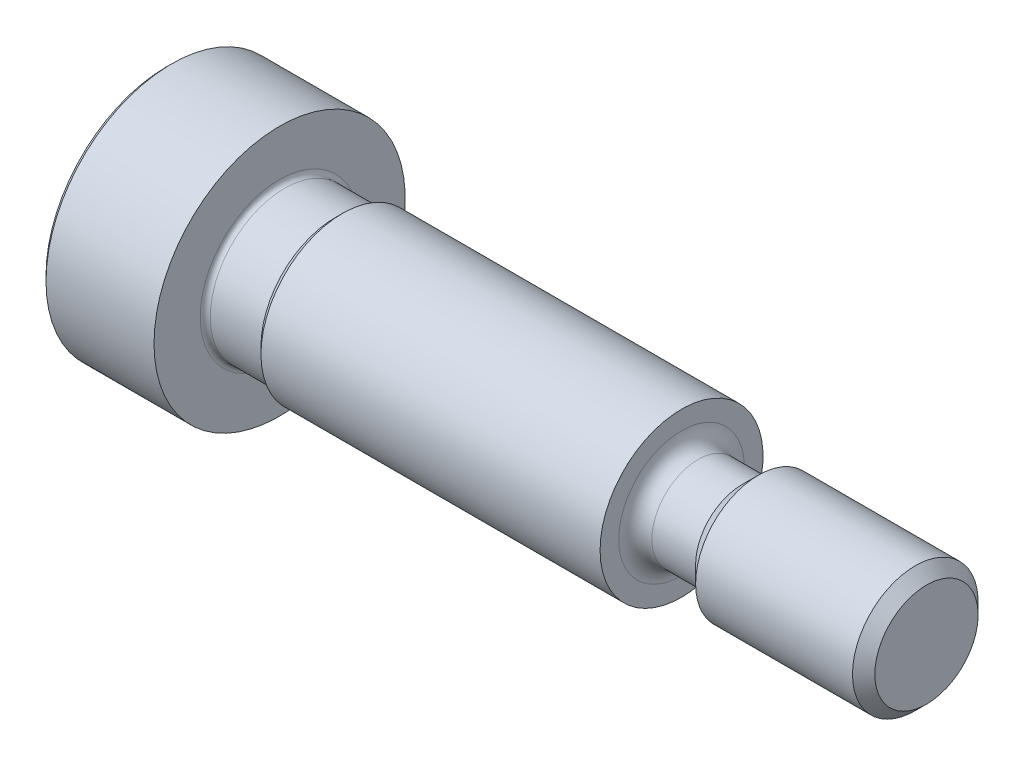
ISO-10303-21;
HEADER;
FILE_DESCRIPTION(('STEP AP214'),'2;1');
FILE_NAME('part.step','',(''),(''),'','','');
FILE_SCHEMA(('AUTOMOTIVE_DESIGN { 1 0 10303 214 1 1 1 1 }'));
ENDSEC;
DATA;
#1=APPLICATION_CONTEXT('core data for automotive mechanical design processes');
#2=APPLICATION_PROTOCOL_DEFINITION('international standard','automotive_design',2000,#1);
#3=PRODUCT_CONTEXT('',#1,'mechanical');
#4=PRODUCT('Part','Part','',(#3));
#5=PRODUCT_RELATED_PRODUCT_CATEGORY('part','',(#4));
#6=PRODUCT_DEFINITION_FORMATION('','',#4);
#7=PRODUCT_DEFINITION_CONTEXT('part definition',#1,'design');
#8=PRODUCT_DEFINITION('design','',#6,#7);
#9=PRODUCT_DEFINITION_SHAPE('','',#8);
#10=(LENGTH_UNIT() NAMED_UNIT(*) SI_UNIT(.MILLI.,.METRE.));
#11=(NAMED_UNIT(*) PLANE_ANGLE_UNIT() SI_UNIT($,.RADIAN.));
#12=(NAMED_UNIT(*) SI_UNIT($,.STERADIAN.) SOLID_ANGLE_UNIT());
#13=UNCERTAINTY_MEASURE_WITH_UNIT(LENGTH_MEASURE(1.E-05),#10,'distance_accuracy_value','');
#14=(GEOMETRIC_REPRESENTATION_CONTEXT(3) GLOBAL_UNCERTAINTY_ASSIGNED_CONTEXT((#13)) GLOBAL_UNIT_ASSIGNED_CONTEXT((#10,
#11,#12)) REPRESENTATION_CONTEXT('',''));
#15=CARTESIAN_POINT('',(0.,0.,0.));
#16=DIRECTION('',(0.,0.,1.));
#17=DIRECTION('',(1.,0.,0.));
#18=AXIS2_PLACEMENT_3D('',#15,#16,#17);
#19=CARTESIAN_POINT('',(0.,0.,0.));
#20=DIRECTION('',(-1.,0.,0.));
#21=DIRECTION('',(0.,0.,1.));
#22=AXIS2_PLACEMENT_3D('',#19,#20,#21);
#23=PLANE('',#22);
#24=CARTESIAN_POINT('',(0.,0.,0.));
#25=DIRECTION('',(-1.,0.,0.));
#26=DIRECTION('',(0.,0.,1.));
#27=AXIS2_PLACEMENT_3D('',#24,#25,#26);
#28=CIRCLE('',#27,4.8);
#29=CARTESIAN_POINT('',(0.,0.,4.8));
#30=VERTEX_POINT('',#29);
#31=EDGE_CURVE('E41',#30,#30,#28,.T.);
#32=ORIENTED_EDGE('',*,*,#31,.T.);
#33=EDGE_LOOP('',(#32));
#34=FACE_BOUND('',#33,.T.);
#35=DIRECTION('',(0.,-0.500000000000001,-0.866025403784438));
#36=VECTOR('',#35,1.);
#37=CARTESIAN_POINT('',(0.,-0.889119414552023,1.54));
#38=LINE('',#37,#36);
#39=CARTESIAN_POINT('',(0.,-0.889119414552023,1.54));
#40=VERTEX_POINT('',#39);
#41=CARTESIAN_POINT('',(0.,-1.77823882910405,0.));
#42=VERTEX_POINT('',#41);
#43=EDGE_CURVE('E48',#40,#42,#38,.T.);
#44=ORIENTED_EDGE('',*,*,#43,.T.);
#45=DIRECTION('',(0.,0.500000000000001,-0.866025403784438));
#46=VECTOR('',#45,1.);
#47=CARTESIAN_POINT('',(0.,-1.77823882910405,0.));
#48=LINE('',#47,#46);
#49=CARTESIAN_POINT('',(0.,-0.889119414552023,-1.54));
#50=VERTEX_POINT('',#49);
#51=EDGE_CURVE('E323',#42,#50,#48,.T.);
#52=ORIENTED_EDGE('',*,*,#51,.T.);
#53=DIRECTION('',(0.,1.,0.));
#54=VECTOR('',#53,1.);
#55=CARTESIAN_POINT('',(0.,-0.889119414552023,-1.54));
#56=LINE('',#55,#54);
#57=CARTESIAN_POINT('',(0.,0.889119414552023,-1.54));
#58=VERTEX_POINT('',#57);
#59=EDGE_CURVE('E128',#50,#58,#56,.T.);
#60=ORIENTED_EDGE('',*,*,#59,.T.);
#61=DIRECTION('',(0.,0.500000000000001,0.866025403784438));
#62=VECTOR('',#61,1.);
#63=CARTESIAN_POINT('',(0.,0.889119414552023,-1.54));
#64=LINE('',#63,#62);
#65=CARTESIAN_POINT('',(0.,1.77823882910405,0.));
#66=VERTEX_POINT('',#65);
#67=EDGE_CURVE('E326',#58,#66,#64,.T.);
#68=ORIENTED_EDGE('',*,*,#67,.T.);
#69=DIRECTION('',(0.,-0.500000000000001,0.866025403784438));
#70=VECTOR('',#69,1.);
#71=CARTESIAN_POINT('',(0.,1.77823882910405,0.));
#72=LINE('',#71,#70);
#73=CARTESIAN_POINT('',(0.,0.889119414552023,1.54));
#74=VERTEX_POINT('',#73);
#75=EDGE_CURVE('E328',#66,#74,#72,.T.);
#76=ORIENTED_EDGE('',*,*,#75,.T.);
#77=DIRECTION('',(0.,-1.,0.));
#78=VECTOR('',#77,1.);
#79=CARTESIAN_POINT('',(0.,0.889119414552023,1.54));
#80=LINE('',#79,#78);
#81=EDGE_CURVE('E330',#74,#40,#80,.T.);
#82=ORIENTED_EDGE('',*,*,#81,.T.);
#83=EDGE_LOOP('',(#44,#52,#60,#68,#76,#82));
#84=FACE_BOUND('',#83,.T.);
#85=ADVANCED_FACE('F33',(#34,#84),#23,.T.);
#86=CARTESIAN_POINT('',(-6.34999999999999,0.,0.));
#87=DIRECTION('',(-1.,0.,0.));
#88=DIRECTION('',(0.,0.,1.));
#89=AXIS2_PLACEMENT_3D('',#86,#87,#88);
#90=CYLINDRICAL_SURFACE('',#89,5.);
#91=CARTESIAN_POINT('',(0.200000000000001,0.,0.));
#92=DIRECTION('',(-1.,0.,0.));
#93=DIRECTION('',(0.,0.,1.));
#94=AXIS2_PLACEMENT_3D('',#91,#92,#93);
#95=CIRCLE('',#94,5.);
#96=CARTESIAN_POINT('',(0.200000000000001,0.,5.));
#97=VERTEX_POINT('',#96);
#98=EDGE_CURVE('E11',#97,#97,#95,.F.);
#99=ORIENTED_EDGE('',*,*,#98,.T.);
#100=EDGE_LOOP('',(#99));
#101=FACE_BOUND('',#100,.T.);
#102=CARTESIAN_POINT('',(4.5,0.,0.));
#103=DIRECTION('',(-1.,0.,0.));
#104=DIRECTION('',(0.,0.,1.));
#105=AXIS2_PLACEMENT_3D('',#102,#103,#104);
#106=CIRCLE('',#105,5.);
#107=CARTESIAN_POINT('',(4.5,0.,5.));
#108=VERTEX_POINT('',#107);
#109=EDGE_CURVE('E175',#108,#108,#106,.T.);
#110=ORIENTED_EDGE('',*,*,#109,.T.);
#111=EDGE_LOOP('',(#110));
#112=FACE_BOUND('',#111,.T.);
#113=ADVANCED_FACE('F194',(#101,#112),#90,.T.);
#114=CARTESIAN_POINT('',(4.5,5.,0.));
#115=DIRECTION('',(1.,0.,0.));
#116=DIRECTION('',(0.,0.,-1.));
#117=AXIS2_PLACEMENT_3D('',#114,#115,#116);
#118=PLANE('',#117);
#119=CARTESIAN_POINT('',(4.5,0.,0.));
#120=DIRECTION('',(-1.,0.,0.));
#121=DIRECTION('',(0.,0.,1.));
#122=AXIS2_PLACEMENT_3D('',#119,#120,#121);
#123=CIRCLE('',#122,3.16);
#124=CARTESIAN_POINT('',(4.5,0.,3.16));
#125=VERTEX_POINT('',#124);
#126=EDGE_CURVE('E172',#125,#125,#123,.T.);
#127=ORIENTED_EDGE('',*,*,#126,.T.);
#128=EDGE_LOOP('',(#127));
#129=FACE_BOUND('',#128,.T.);
#130=ORIENTED_EDGE('',*,*,#109,.F.);
#131=EDGE_LOOP('',(#130));
#132=FACE_BOUND('',#131,.T.);
#133=ADVANCED_FACE('F198',(#129,#132),#118,.T.);
#134=CARTESIAN_POINT('',(4.7,0.,0.));
#135=DIRECTION('',(-1.,0.,0.));
#136=DIRECTION('',(0.,0.,1.));
#137=AXIS2_PLACEMENT_3D('',#134,#135,#136);
#138=TOROIDAL_SURFACE('',#137,3.16,0.200000000000001);
#139=ORIENTED_EDGE('',*,*,#126,.F.);
#140=EDGE_LOOP('',(#139));
#141=FACE_BOUND('',#140,.T.);
#142=CARTESIAN_POINT('',(4.7,0.,0.));
#143=DIRECTION('',(-1.,0.,0.));
#144=DIRECTION('',(0.,0.,1.));
#145=AXIS2_PLACEMENT_3D('',#142,#143,#144);
#146=CIRCLE('',#145,2.96);
#147=CARTESIAN_POINT('',(4.7,0.,2.96));
#148=VERTEX_POINT('',#147);
#149=EDGE_CURVE('E169',#148,#148,#146,.T.);
#150=ORIENTED_EDGE('',*,*,#149,.T.);
#151=EDGE_LOOP('',(#150));
#152=FACE_BOUND('',#151,.T.);
#153=ADVANCED_FACE('F204',(#141,#152),#138,.F.);
#154=CARTESIAN_POINT('',(-6.34999999999999,0.,0.));
#155=DIRECTION('',(-1.,0.,0.));
#156=DIRECTION('',(0.,0.,1.));
#157=AXIS2_PLACEMENT_3D('',#154,#155,#156);
#158=CYLINDRICAL_SURFACE('',#157,2.96);
#159=CARTESIAN_POINT('',(6.7165,0.,0.));
#160=DIRECTION('',(-1.,0.,0.));
#161=DIRECTION('',(0.,0.,1.));
#162=AXIS2_PLACEMENT_3D('',#159,#160,#161);
#163=CIRCLE('',#162,2.96);
#164=CARTESIAN_POINT('',(6.7165,0.,2.96));
#165=VERTEX_POINT('',#164);
#166=EDGE_CURVE('E166',#165,#165,#163,.T.);
#167=ORIENTED_EDGE('',*,*,#166,.T.);
#168=EDGE_LOOP('',(#167));
#169=FACE_BOUND('',#168,.T.);
#170=ORIENTED_EDGE('',*,*,#149,.F.);
#171=EDGE_LOOP('',(#170));
#172=FACE_BOUND('',#171,.T.);
#173=ADVANCED_FACE('F208',(#169,#172),#158,.T.);
#174=CARTESIAN_POINT('',(6.7165,0.,0.));
#175=DIRECTION('',(1.,0.,0.));
#176=DIRECTION('',(0.,0.,-1.));
#177=AXIS2_PLACEMENT_3D('',#174,#175,#176);
#178=CONICAL_SURFACE('',#177,2.96,0.78539816339745);
#179=CARTESIAN_POINT('',(7.,0.,0.));
#180=DIRECTION('',(-1.,0.,0.));
#181=DIRECTION('',(0.,0.,1.));
#182=AXIS2_PLACEMENT_3D('',#179,#180,#181);
#183=CIRCLE('',#182,3.2435);
#184=CARTESIAN_POINT('',(7.,0.,3.2435));
#185=VERTEX_POINT('',#184);
#186=EDGE_CURVE('E163',#185,#185,#183,.T.);
#187=ORIENTED_EDGE('',*,*,#186,.T.);
#188=EDGE_LOOP('',(#187));
#189=FACE_BOUND('',#188,.T.);
#190=ORIENTED_EDGE('',*,*,#166,.F.);
#191=EDGE_LOOP('',(#190));
#192=FACE_BOUND('',#191,.T.);
#193=ADVANCED_FACE('F212',(#189,#192),#178,.T.);
#194=CARTESIAN_POINT('',(-6.34999999999999,0.,0.));
#195=DIRECTION('',(-1.,0.,0.));
#196=DIRECTION('',(0.,0.,1.));
#197=AXIS2_PLACEMENT_3D('',#194,#195,#196);
#198=CYLINDRICAL_SURFACE('',#197,3.2435);
#199=CARTESIAN_POINT('',(20.5,0.,0.));
#200=DIRECTION('',(-1.,0.,0.));
#201=DIRECTION('',(0.,0.,1.));
#202=AXIS2_PLACEMENT_3D('',#199,#200,#201);
#203=CIRCLE('',#202,3.2435);
#204=CARTESIAN_POINT('',(20.5,0.,3.2435));
#205=VERTEX_POINT('',#204);
#206=EDGE_CURVE('E160',#205,#205,#203,.T.);
#207=ORIENTED_EDGE('',*,*,#206,.T.);
#208=EDGE_LOOP('',(#207));
#209=FACE_BOUND('',#208,.T.);
#210=ORIENTED_EDGE('',*,*,#186,.F.);
#211=EDGE_LOOP('',(#210));
#212=FACE_BOUND('',#211,.T.);
#213=ADVANCED_FACE('F216',(#209,#212),#198,.T.);
#214=CARTESIAN_POINT('',(20.5,3.2435,0.));
#215=DIRECTION('',(1.,0.,0.));
#216=DIRECTION('',(0.,0.,-1.));
#217=AXIS2_PLACEMENT_3D('',#214,#215,#216);
#218=PLANE('',#217);
#219=CARTESIAN_POINT('',(20.5,0.,0.));
#220=DIRECTION('',(-1.,0.,0.));
#221=DIRECTION('',(0.,0.,1.));
#222=AXIS2_PLACEMENT_3D('',#219,#220,#221);
#223=CIRCLE('',#222,2.5);
#224=CARTESIAN_POINT('',(20.5,0.,2.5));
#225=VERTEX_POINT('',#224);
#226=EDGE_CURVE('E157',#225,#225,#223,.T.);
#227=ORIENTED_EDGE('',*,*,#226,.T.);
#228=EDGE_LOOP('',(#227));
#229=FACE_BOUND('',#228,.T.);
#230=ORIENTED_EDGE('',*,*,#206,.F.);
#231=EDGE_LOOP('',(#230));
#232=FACE_BOUND('',#231,.T.);
#233=ADVANCED_FACE('F220',(#229,#232),#218,.T.);
#234=CARTESIAN_POINT('',(21.16,0.,0.));
#235=DIRECTION('',(-1.,0.,0.));
#236=DIRECTION('',(0.,0.,1.));
#237=AXIS2_PLACEMENT_3D('',#234,#235,#236);
#238=TOROIDAL_SURFACE('',#237,2.5,0.66);
#239=CARTESIAN_POINT('',(21.16,0.,0.));
#240=DIRECTION('',(-1.,0.,0.));
#241=DIRECTION('',(0.,0.,1.));
#242=AXIS2_PLACEMENT_3D('',#239,#240,#241);
#243=CIRCLE('',#242,1.84);
#244=CARTESIAN_POINT('',(21.16,0.,1.84));
#245=VERTEX_POINT('',#244);
#246=EDGE_CURVE('E154',#245,#245,#243,.T.);
#247=ORIENTED_EDGE('',*,*,#246,.T.);
#248=EDGE_LOOP('',(#247));
#249=FACE_BOUND('',#248,.T.);
#250=ORIENTED_EDGE('',*,*,#226,.F.);
#251=EDGE_LOOP('',(#250));
#252=FACE_BOUND('',#251,.T.);
#253=ADVANCED_FACE('F224',(#249,#252),#238,.F.);
#254=CARTESIAN_POINT('',(-6.34999999999999,0.,0.));
#255=DIRECTION('',(-1.,0.,0.));
#256=DIRECTION('',(0.,0.,1.));
#257=AXIS2_PLACEMENT_3D('',#254,#255,#256);
#258=CYLINDRICAL_SURFACE('',#257,1.84);
#259=CARTESIAN_POINT('',(22.9,0.,0.));
#260=DIRECTION('',(-1.,0.,0.));
#261=DIRECTION('',(0.,0.,1.));
#262=AXIS2_PLACEMENT_3D('',#259,#260,#261);
#263=CIRCLE('',#262,1.84);
#264=CARTESIAN_POINT('',(22.9,0.,1.84));
#265=VERTEX_POINT('',#264);
#266=EDGE_CURVE('E151',#265,#265,#263,.T.);
#267=ORIENTED_EDGE('',*,*,#266,.T.);
#268=EDGE_LOOP('',(#267));
#269=FACE_BOUND('',#268,.T.);
#270=ORIENTED_EDGE('',*,*,#246,.F.);
#271=EDGE_LOOP('',(#270));
#272=FACE_BOUND('',#271,.T.);
#273=ADVANCED_FACE('F228',(#269,#272),#258,.T.);
#274=CARTESIAN_POINT('',(22.9,0.,0.));
#275=DIRECTION('',(1.,0.,0.));
#276=DIRECTION('',(0.,0.,-1.));
#277=AXIS2_PLACEMENT_3D('',#274,#275,#276);
#278=CONICAL_SURFACE('',#277,1.84,0.785398163397448);
#279=CARTESIAN_POINT('',(23.56,0.,0.));
#280=DIRECTION('',(-1.,0.,0.));
#281=DIRECTION('',(0.,0.,1.));
#282=AXIS2_PLACEMENT_3D('',#279,#280,#281);
#283=CIRCLE('',#282,2.5);
#284=CARTESIAN_POINT('',(23.56,0.,2.5));
#285=VERTEX_POINT('',#284);
#286=EDGE_CURVE('E148',#285,#285,#283,.T.);
#287=ORIENTED_EDGE('',*,*,#286,.T.);
#288=EDGE_LOOP('',(#287));
#289=FACE_BOUND('',#288,.T.);
#290=ORIENTED_EDGE('',*,*,#266,.F.);
#291=EDGE_LOOP('',(#290));
#292=FACE_BOUND('',#291,.T.);
#293=ADVANCED_FACE('F232',(#289,#292),#278,.T.);
#294=CARTESIAN_POINT('',(-6.34999999999999,0.,0.));
#295=DIRECTION('',(-1.,0.,0.));
#296=DIRECTION('',(0.,0.,1.));
#297=AXIS2_PLACEMENT_3D('',#294,#295,#296);
#298=CYLINDRICAL_SURFACE('',#297,2.5);
#299=CARTESIAN_POINT('',(29.805,0.,0.));
#300=DIRECTION('',(-1.,0.,0.));
#301=DIRECTION('',(0.,0.,1.));
#302=AXIS2_PLACEMENT_3D('',#299,#300,#301);
#303=CIRCLE('',#302,2.5);
#304=CARTESIAN_POINT('',(29.805,0.,2.5));
#305=VERTEX_POINT('',#304);
#306=EDGE_CURVE('E145',#305,#305,#303,.T.);
#307=ORIENTED_EDGE('',*,*,#306,.T.);
#308=EDGE_LOOP('',(#307));
#309=FACE_BOUND('',#308,.T.);
#310=ORIENTED_EDGE('',*,*,#286,.F.);
#311=EDGE_LOOP('',(#310));
#312=FACE_BOUND('',#311,.T.);
#313=ADVANCED_FACE('F236',(#309,#312),#298,.T.);
#314=CARTESIAN_POINT('',(29.805,0.,0.));
#315=DIRECTION('',(-1.,0.,0.));
#316=DIRECTION('',(0.,0.,1.));
#317=AXIS2_PLACEMENT_3D('',#314,#315,#316);
#318=CONICAL_SURFACE('',#317,2.5,0.785398163397445);
#319=CARTESIAN_POINT('',(30.25,0.,0.));
#320=DIRECTION('',(-1.,0.,0.));
#321=DIRECTION('',(0.,0.,1.));
#322=AXIS2_PLACEMENT_3D('',#319,#320,#321);
#323=CIRCLE('',#322,2.055);
#324=CARTESIAN_POINT('',(30.25,0.,2.055));
#325=VERTEX_POINT('',#324);
#326=EDGE_CURVE('E141',#325,#325,#323,.T.);
#327=ORIENTED_EDGE('',*,*,#326,.T.);
#328=EDGE_LOOP('',(#327));
#329=FACE_BOUND('',#328,.T.);
#330=ORIENTED_EDGE('',*,*,#306,.F.);
#331=EDGE_LOOP('',(#330));
#332=FACE_BOUND('',#331,.T.);
#333=ADVANCED_FACE('F189',(#329,#332),#318,.T.);
#334=CARTESIAN_POINT('',(30.25,2.055,0.));
#335=DIRECTION('',(1.,0.,0.));
#336=DIRECTION('',(0.,0.,-1.));
#337=AXIS2_PLACEMENT_3D('',#334,#335,#336);
#338=PLANE('',#337);
#339=ORIENTED_EDGE('',*,*,#326,.F.);
#340=EDGE_LOOP('',(#339));
#341=FACE_BOUND('',#340,.T.);
#342=ADVANCED_FACE('F182',(#341),#338,.T.);
#343=CARTESIAN_POINT('',(0.,0.,0.));
#344=DIRECTION('',(1.,0.,0.));
#345=DIRECTION('',(0.,0.,-1.));
#346=AXIS2_PLACEMENT_3D('',#343,#344,#345);
#347=CONICAL_SURFACE('',#346,4.8,0.785398163397446);
#348=ORIENTED_EDGE('',*,*,#98,.F.);
#349=EDGE_LOOP('',(#348));
#350=FACE_BOUND('',#349,.T.);
#351=ORIENTED_EDGE('',*,*,#31,.F.);
#352=EDGE_LOOP('',(#351));
#353=FACE_BOUND('',#352,.T.);
#354=ADVANCED_FACE('F35',(#350,#353),#347,.T.);
#355=CARTESIAN_POINT('',(2.4,-1.77823882910405,0.));
#356=DIRECTION('',(0.,0.866025403784438,0.500000000000001));
#357=DIRECTION('',(0.,-0.500000000000001,0.866025403784438));
#358=AXIS2_PLACEMENT_3D('',#355,#356,#357);
#359=PLANE('',#358);
#360=DIRECTION('',(0.,0.500000000000001,-0.866025403784438));
#361=VECTOR('',#360,1.);
#362=CARTESIAN_POINT('',(2.4,-1.77823882910405,0.));
#363=LINE('',#362,#361);
#364=CARTESIAN_POINT('',(2.4,-1.77823882910405,0.));
#365=VERTEX_POINT('',#364);
#366=CARTESIAN_POINT('',(2.4,-1.33367912182803,-0.770000000000002));
#367=VERTEX_POINT('',#366);
#368=EDGE_CURVE('E56',#365,#367,#363,.T.);
#369=ORIENTED_EDGE('',*,*,#368,.T.);
#370=CARTESIAN_POINT('',(2.4,-0.889119414552023,-1.54));
#371=VERTEX_POINT('',#370);
#372=EDGE_CURVE('E106',#367,#371,#363,.T.);
#373=ORIENTED_EDGE('',*,*,#372,.T.);
#374=DIRECTION('',(-1.,0.,0.));
#375=VECTOR('',#374,1.);
#376=CARTESIAN_POINT('',(2.4,-0.889119414552023,-1.54));
#377=LINE('',#376,#375);
#378=EDGE_CURVE('E110',#371,#50,#377,.T.);
#379=ORIENTED_EDGE('',*,*,#378,.T.);
#380=ORIENTED_EDGE('',*,*,#51,.F.);
#381=DIRECTION('',(-1.,0.,0.));
#382=VECTOR('',#381,1.);
#383=CARTESIAN_POINT('',(2.4,-1.77823882910405,0.));
#384=LINE('',#383,#382);
#385=EDGE_CURVE('E322',#365,#42,#384,.T.);
#386=ORIENTED_EDGE('',*,*,#385,.F.);
#387=EDGE_LOOP('',(#369,#373,#379,#380,#386));
#388=FACE_BOUND('',#387,.T.);
#389=ADVANCED_FACE('F108',(#388),#359,.T.);
#390=CARTESIAN_POINT('',(2.4,-0.889119414552023,-1.54));
#391=DIRECTION('',(0.,0.,1.));
#392=DIRECTION('',(1.,0.,0.));
#393=AXIS2_PLACEMENT_3D('',#390,#391,#392);
#394=PLANE('',#393);
#395=DIRECTION('',(0.,1.,0.));
#396=VECTOR('',#395,1.);
#397=CARTESIAN_POINT('',(2.4,-0.889119414552023,-1.54));
#398=LINE('',#397,#396);
#399=CARTESIAN_POINT('',(2.4,0.,-1.54));
#400=VERTEX_POINT('',#399);
#401=EDGE_CURVE('E115',#371,#400,#398,.T.);
#402=ORIENTED_EDGE('',*,*,#401,.T.);
#403=CARTESIAN_POINT('',(2.4,0.889119414552023,-1.54));
#404=VERTEX_POINT('',#403);
#405=EDGE_CURVE('E123',#400,#404,#398,.T.);
#406=ORIENTED_EDGE('',*,*,#405,.T.);
#407=DIRECTION('',(-1.,0.,0.));
#408=VECTOR('',#407,1.);
#409=CARTESIAN_POINT('',(2.4,0.889119414552023,-1.54));
#410=LINE('',#409,#408);
#411=EDGE_CURVE('E130',#404,#58,#410,.T.);
#412=ORIENTED_EDGE('',*,*,#411,.T.);
#413=ORIENTED_EDGE('',*,*,#59,.F.);
#414=ORIENTED_EDGE('',*,*,#378,.F.);
#415=EDGE_LOOP('',(#402,#406,#412,#413,#414));
#416=FACE_BOUND('',#415,.T.);
#417=ADVANCED_FACE('F126',(#416),#394,.T.);
#418=CARTESIAN_POINT('',(2.4,0.889119414552023,-1.54));
#419=DIRECTION('',(0.,-0.866025403784438,0.500000000000001));
#420=DIRECTION('',(0.,-0.500000000000001,-0.866025403784438));
#421=AXIS2_PLACEMENT_3D('',#418,#419,#420);
#422=PLANE('',#421);
#423=DIRECTION('',(0.,0.500000000000001,0.866025403784438));
#424=VECTOR('',#423,1.);
#425=CARTESIAN_POINT('',(2.4,0.889119414552023,-1.54));
#426=LINE('',#425,#424);
#427=CARTESIAN_POINT('',(2.4,1.33367912182803,-0.770000000000002));
#428=VERTEX_POINT('',#427);
#429=EDGE_CURVE('E286',#404,#428,#426,.T.);
#430=ORIENTED_EDGE('',*,*,#429,.T.);
#431=CARTESIAN_POINT('',(2.4,1.77823882910405,0.));
#432=VERTEX_POINT('',#431);
#433=EDGE_CURVE('E122',#428,#432,#426,.T.);
#434=ORIENTED_EDGE('',*,*,#433,.T.);
#435=DIRECTION('',(-1.,0.,0.));
#436=VECTOR('',#435,1.);
#437=CARTESIAN_POINT('',(2.4,1.77823882910405,0.));
#438=LINE('',#437,#436);
#439=EDGE_CURVE('E136',#432,#66,#438,.T.);
#440=ORIENTED_EDGE('',*,*,#439,.T.);
#441=ORIENTED_EDGE('',*,*,#67,.F.);
#442=ORIENTED_EDGE('',*,*,#411,.F.);
#443=EDGE_LOOP('',(#430,#434,#440,#441,#442));
#444=FACE_BOUND('',#443,.T.);
#445=ADVANCED_FACE('F250',(#444),#422,.T.);
#446=CARTESIAN_POINT('',(2.4,1.77823882910405,0.));
#447=DIRECTION('',(0.,-0.866025403784438,-0.500000000000001));
#448=DIRECTION('',(0.,0.500000000000001,-0.866025403784438));
#449=AXIS2_PLACEMENT_3D('',#446,#447,#448);
#450=PLANE('',#449);
#451=DIRECTION('',(0.,-0.500000000000001,0.866025403784438));
#452=VECTOR('',#451,1.);
#453=CARTESIAN_POINT('',(2.4,1.77823882910405,0.));
#454=LINE('',#453,#452);
#455=CARTESIAN_POINT('',(2.4,1.33367912182803,0.770000000000002));
#456=VERTEX_POINT('',#455);
#457=EDGE_CURVE('E291',#432,#456,#454,.T.);
#458=ORIENTED_EDGE('',*,*,#457,.T.);
#459=CARTESIAN_POINT('',(2.4,0.889119414552023,1.54));
#460=VERTEX_POINT('',#459);
#461=EDGE_CURVE('E297',#456,#460,#454,.T.);
#462=ORIENTED_EDGE('',*,*,#461,.T.);
#463=DIRECTION('',(-1.,0.,0.));
#464=VECTOR('',#463,1.);
#465=CARTESIAN_POINT('',(2.4,0.889119414552023,1.54));
#466=LINE('',#465,#464);
#467=EDGE_CURVE('E317',#460,#74,#466,.T.);
#468=ORIENTED_EDGE('',*,*,#467,.T.);
#469=ORIENTED_EDGE('',*,*,#75,.F.);
#470=ORIENTED_EDGE('',*,*,#439,.F.);
#471=EDGE_LOOP('',(#458,#462,#468,#469,#470));
#472=FACE_BOUND('',#471,.T.);
#473=ADVANCED_FACE('F253',(#472),#450,.T.);
#474=CARTESIAN_POINT('',(2.4,0.889119414552023,1.54));
#475=DIRECTION('',(0.,0.,-1.));
#476=DIRECTION('',(-1.,0.,0.));
#477=AXIS2_PLACEMENT_3D('',#474,#475,#476);
#478=PLANE('',#477);
#479=DIRECTION('',(0.,-1.,0.));
#480=VECTOR('',#479,1.);
#481=CARTESIAN_POINT('',(2.4,0.889119414552023,1.54));
#482=LINE('',#481,#480);
#483=CARTESIAN_POINT('',(2.4,0.,1.54));
#484=VERTEX_POINT('',#483);
#485=EDGE_CURVE('E304',#460,#484,#482,.T.);
#486=ORIENTED_EDGE('',*,*,#485,.T.);
#487=CARTESIAN_POINT('',(2.4,-0.889119414552023,1.54));
#488=VERTEX_POINT('',#487);
#489=EDGE_CURVE('E307',#484,#488,#482,.T.);
#490=ORIENTED_EDGE('',*,*,#489,.T.);
#491=DIRECTION('',(-1.,0.,0.));
#492=VECTOR('',#491,1.);
#493=CARTESIAN_POINT('',(2.4,-0.889119414552023,1.54));
#494=LINE('',#493,#492);
#495=EDGE_CURVE('E335',#488,#40,#494,.T.);
#496=ORIENTED_EDGE('',*,*,#495,.T.);
#497=ORIENTED_EDGE('',*,*,#81,.F.);
#498=ORIENTED_EDGE('',*,*,#467,.F.);
#499=EDGE_LOOP('',(#486,#490,#496,#497,#498));
#500=FACE_BOUND('',#499,.T.);
#501=ADVANCED_FACE('F257',(#500),#478,.T.);
#502=CARTESIAN_POINT('',(2.4,-0.889119414552023,1.54));
#503=DIRECTION('',(0.,0.866025403784438,-0.500000000000001));
#504=DIRECTION('',(0.,0.500000000000001,0.866025403784438));
#505=AXIS2_PLACEMENT_3D('',#502,#503,#504);
#506=PLANE('',#505);
#507=DIRECTION('',(0.,-0.500000000000001,-0.866025403784438));
#508=VECTOR('',#507,1.);
#509=CARTESIAN_POINT('',(2.4,-0.889119414552023,1.54));
#510=LINE('',#509,#508);
#511=CARTESIAN_POINT('',(2.4,-1.33367912182803,0.770000000000002));
#512=VERTEX_POINT('',#511);
#513=EDGE_CURVE('E310',#488,#512,#510,.T.);
#514=ORIENTED_EDGE('',*,*,#513,.T.);
#515=EDGE_CURVE('E318',#512,#365,#510,.T.);
#516=ORIENTED_EDGE('',*,*,#515,.T.);
#517=ORIENTED_EDGE('',*,*,#385,.T.);
#518=ORIENTED_EDGE('',*,*,#43,.F.);
#519=ORIENTED_EDGE('',*,*,#495,.F.);
#520=EDGE_LOOP('',(#514,#516,#517,#518,#519));
#521=FACE_BOUND('',#520,.T.);
#522=ADVANCED_FACE('F261',(#521),#506,.T.);
#523=CARTESIAN_POINT('',(2.4,0.,-3.07999999999999));
#524=DIRECTION('',(1.,0.,0.));
#525=DIRECTION('',(0.,0.,-1.));
#526=AXIS2_PLACEMENT_3D('',#523,#524,#525);
#527=PLANE('',#526);
#528=CARTESIAN_POINT('',(2.4,0.,0.));
#529=DIRECTION('',(-1.,0.,0.));
#530=DIRECTION('',(0.,0.,1.));
#531=AXIS2_PLACEMENT_3D('',#528,#529,#530);
#532=CIRCLE('',#531,1.54);
#533=EDGE_CURVE('E283',#428,#400,#532,.T.);
#534=ORIENTED_EDGE('',*,*,#533,.F.);
#535=ORIENTED_EDGE('',*,*,#429,.F.);
#536=ORIENTED_EDGE('',*,*,#405,.F.);
#537=EDGE_LOOP('',(#534,#535,#536));
#538=FACE_BOUND('',#537,.T.);
#539=ADVANCED_FACE('F265',(#538),#527,.F.);
#540=EDGE_CURVE('E142',#456,#428,#532,.T.);
#541=ORIENTED_EDGE('',*,*,#540,.F.);
#542=ORIENTED_EDGE('',*,*,#457,.F.);
#543=ORIENTED_EDGE('',*,*,#433,.F.);
#544=EDGE_LOOP('',(#541,#542,#543));
#545=FACE_BOUND('',#544,.T.);
#546=ADVANCED_FACE('F275',(#545),#527,.F.);
#547=EDGE_CURVE('E135',#484,#456,#532,.T.);
#548=ORIENTED_EDGE('',*,*,#547,.F.);
#549=ORIENTED_EDGE('',*,*,#485,.F.);
#550=ORIENTED_EDGE('',*,*,#461,.F.);
#551=EDGE_LOOP('',(#548,#549,#550));
#552=FACE_BOUND('',#551,.T.);
#553=ADVANCED_FACE('F280',(#552),#527,.F.);
#554=EDGE_CURVE('E129',#512,#484,#532,.T.);
#555=ORIENTED_EDGE('',*,*,#554,.F.);
#556=ORIENTED_EDGE('',*,*,#513,.F.);
#557=ORIENTED_EDGE('',*,*,#489,.F.);
#558=EDGE_LOOP('',(#555,#556,#557));
#559=FACE_BOUND('',#558,.T.);
#560=ADVANCED_FACE('F272',(#559),#527,.F.);
#561=EDGE_CURVE('E133',#367,#512,#532,.T.);
#562=ORIENTED_EDGE('',*,*,#561,.F.);
#563=ORIENTED_EDGE('',*,*,#368,.F.);
#564=ORIENTED_EDGE('',*,*,#515,.F.);
#565=EDGE_LOOP('',(#562,#563,#564));
#566=FACE_BOUND('',#565,.T.);
#567=ADVANCED_FACE('F268',(#566),#527,.F.);
#568=EDGE_CURVE('E118',#400,#367,#532,.T.);
#569=ORIENTED_EDGE('',*,*,#568,.F.);
#570=ORIENTED_EDGE('',*,*,#401,.F.);
#571=ORIENTED_EDGE('',*,*,#372,.F.);
#572=EDGE_LOOP('',(#569,#570,#571));
#573=FACE_BOUND('',#572,.T.);
#574=ADVANCED_FACE('F116',(#573),#527,.F.);
#575=CARTESIAN_POINT('',(3.28911941455203,0.,0.));
#576=DIRECTION('',(-1.,0.,0.));
#577=DIRECTION('',(0.,0.,1.));
#578=AXIS2_PLACEMENT_3D('',#575,#576,#577);
#579=CONICAL_SURFACE('',#578,0.,1.04719755119659);
#580=ORIENTED_EDGE('',*,*,#547,.T.);
#581=ORIENTED_EDGE('',*,*,#540,.T.);
#582=ORIENTED_EDGE('',*,*,#533,.T.);
#583=ORIENTED_EDGE('',*,*,#568,.T.);
#584=ORIENTED_EDGE('',*,*,#561,.T.);
#585=ORIENTED_EDGE('',*,*,#554,.T.);
#586=EDGE_LOOP('',(#580,#581,#582,#583,#584,#585));
#587=FACE_BOUND('',#586,.T.);
#588=CARTESIAN_POINT('',(3.28911941455203,0.,0.));
#589=VERTEX_POINT('',#588);
#590=VERTEX_LOOP('',#589);
#591=FACE_BOUND('',#590,.T.);
#592=ADVANCED_FACE('F244',(#587,#591),#579,.F.);
#593=CLOSED_SHELL('',(#85,#113,#133,#153,#173,#193,#213,#233,#253,#273,#293,#313,#333,#342,#354,
#389,#417,#445,#473,#501,#522,#539,#546,#553,#560,#567,#574,#592));
#594=MANIFOLD_SOLID_BREP('B2',#593);
#595=ADVANCED_BREP_SHAPE_REPRESENTATION('',(#18,#594),#14);
#596=SHAPE_DEFINITION_REPRESENTATION(#9,#595);
ENDSEC;
END-ISO-10303-21;
